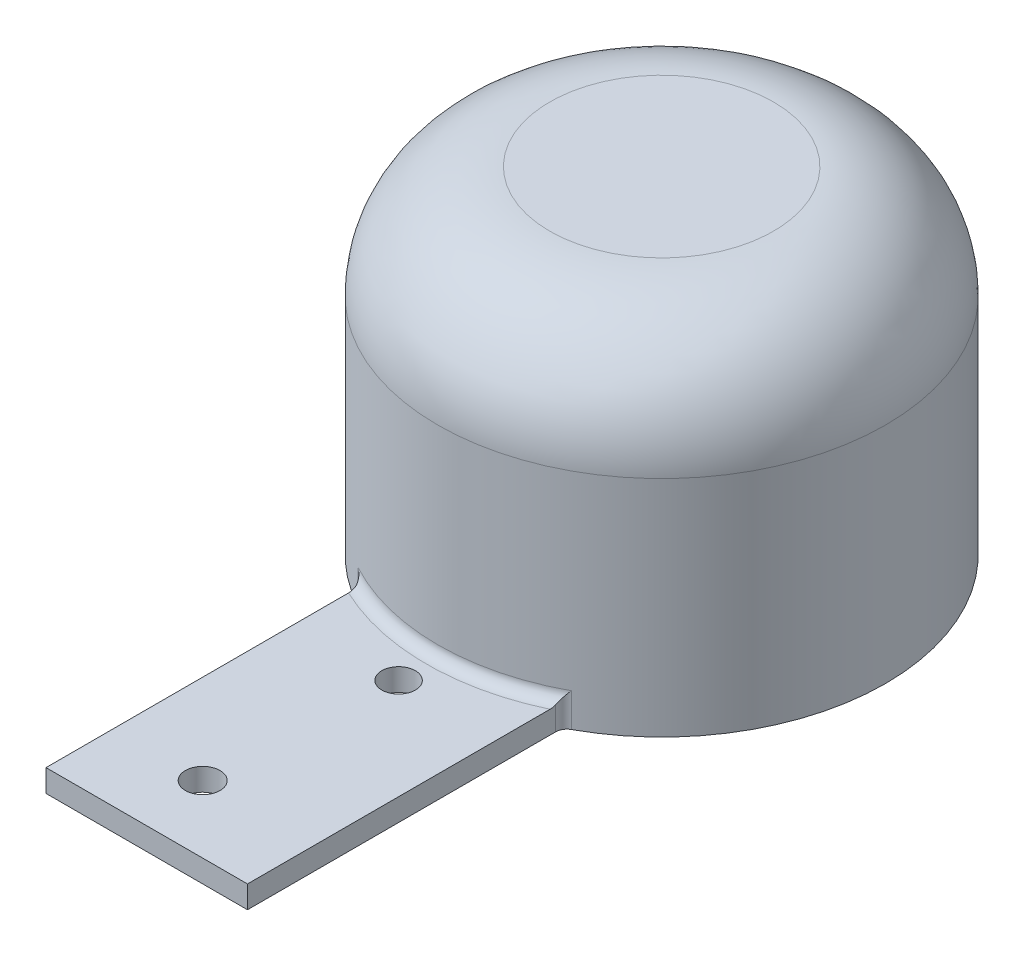
ISO-10303-21;
HEADER;
FILE_DESCRIPTION(('STEP AP214'),'2;1');
FILE_NAME('part.step','',(''),(''),'','','');
FILE_SCHEMA(('AUTOMOTIVE_DESIGN { 1 0 10303 214 1 1 1 1 }'));
ENDSEC;
DATA;
#1=APPLICATION_CONTEXT('core data for automotive mechanical design processes');
#2=APPLICATION_PROTOCOL_DEFINITION('international standard','automotive_design',2000,#1);
#3=PRODUCT_CONTEXT('',#1,'mechanical');
#4=PRODUCT('Part','Part','',(#3));
#5=PRODUCT_RELATED_PRODUCT_CATEGORY('part','',(#4));
#6=PRODUCT_DEFINITION_FORMATION('','',#4);
#7=PRODUCT_DEFINITION_CONTEXT('part definition',#1,'design');
#8=PRODUCT_DEFINITION('design','',#6,#7);
#9=PRODUCT_DEFINITION_SHAPE('','',#8);
#10=(LENGTH_UNIT() NAMED_UNIT(*) SI_UNIT(.MILLI.,.METRE.));
#11=(NAMED_UNIT(*) PLANE_ANGLE_UNIT() SI_UNIT($,.RADIAN.));
#12=(NAMED_UNIT(*) SI_UNIT($,.STERADIAN.) SOLID_ANGLE_UNIT());
#13=UNCERTAINTY_MEASURE_WITH_UNIT(LENGTH_MEASURE(1.E-05),#10,'distance_accuracy_value','');
#14=(GEOMETRIC_REPRESENTATION_CONTEXT(3) GLOBAL_UNCERTAINTY_ASSIGNED_CONTEXT((#13)) GLOBAL_UNIT_ASSIGNED_CONTEXT((#10,
#11,#12)) REPRESENTATION_CONTEXT('',''));
#15=CARTESIAN_POINT('',(0.,0.,0.));
#16=DIRECTION('',(0.,0.,1.));
#17=DIRECTION('',(1.,0.,0.));
#18=AXIS2_PLACEMENT_3D('',#15,#16,#17);
#19=CARTESIAN_POINT('',(0.,30.,0.));
#20=DIRECTION('',(0.,-1.,0.));
#21=DIRECTION('',(0.,0.,-1.));
#22=AXIS2_PLACEMENT_3D('',#19,#20,#21);
#23=CYLINDRICAL_SURFACE('',#22,20.);
#24=CARTESIAN_POINT('',(0.,20.,0.));
#25=DIRECTION('',(0.,1.,0.));
#26=DIRECTION('',(0.,0.,1.));
#27=AXIS2_PLACEMENT_3D('',#24,#25,#26);
#28=CIRCLE('',#27,20.);
#29=CARTESIAN_POINT('',(0.,20.,20.));
#30=VERTEX_POINT('',#29);
#31=EDGE_CURVE('E11',#30,#30,#28,.F.);
#32=ORIENTED_EDGE('',*,*,#31,.T.);
#33=EDGE_LOOP('',(#32));
#34=FACE_BOUND('',#33,.T.);
#35=CARTESIAN_POINT('',(0.,0.,0.));
#36=DIRECTION('',(0.,1.,0.));
#37=DIRECTION('',(0.,0.,1.));
#38=AXIS2_PLACEMENT_3D('',#35,#36,#37);
#39=CIRCLE('',#38,20.);
#40=CARTESIAN_POINT('',(9.52380952380952,0.,17.5868431548756));
#41=VERTEX_POINT('',#40);
#42=CARTESIAN_POINT('',(-9.52380952380952,0.,17.5868431548756));
#43=VERTEX_POINT('',#42);
#44=EDGE_CURVE('E138',#41,#43,#39,.T.);
#45=ORIENTED_EDGE('',*,*,#44,.T.);
#46=DIRECTION('',(0.,-1.,0.));
#47=VECTOR('',#46,1.);
#48=CARTESIAN_POINT('',(-9.52380952380952,30.,17.5868431548756));
#49=LINE('',#48,#47);
#50=CARTESIAN_POINT('',(-9.52380952380952,3.,17.5868431548756));
#51=VERTEX_POINT('',#50);
#52=EDGE_CURVE('E147',#43,#51,#49,.F.);
#53=ORIENTED_EDGE('',*,*,#52,.T.);
#54=CARTESIAN_POINT('',(0.,3.,0.));
#55=DIRECTION('',(0.,1.,0.));
#56=DIRECTION('',(0.,0.,1.));
#57=AXIS2_PLACEMENT_3D('',#54,#55,#56);
#58=CIRCLE('',#57,20.);
#59=CARTESIAN_POINT('',(9.52380952380952,3.,17.5868431548756));
#60=VERTEX_POINT('',#59);
#61=EDGE_CURVE('E143',#51,#60,#58,.T.);
#62=ORIENTED_EDGE('',*,*,#61,.T.);
#63=DIRECTION('',(0.,-1.,0.));
#64=VECTOR('',#63,1.);
#65=CARTESIAN_POINT('',(9.52380952380952,30.,17.5868431548756));
#66=LINE('',#65,#64);
#67=EDGE_CURVE('E145',#60,#41,#66,.T.);
#68=ORIENTED_EDGE('',*,*,#67,.T.);
#69=EDGE_LOOP('',(#45,#53,#62,#68));
#70=FACE_BOUND('',#69,.T.);
#71=ADVANCED_FACE('F40',(#34,#70),#23,.T.);
#72=CARTESIAN_POINT('',(0.,30.,0.));
#73=DIRECTION('',(0.,1.,0.));
#74=DIRECTION('',(0.,0.,1.));
#75=AXIS2_PLACEMENT_3D('',#72,#73,#74);
#76=PLANE('',#75);
#77=CARTESIAN_POINT('',(0.,30.,0.));
#78=DIRECTION('',(0.,1.,0.));
#79=DIRECTION('',(0.,0.,1.));
#80=AXIS2_PLACEMENT_3D('',#77,#78,#79);
#81=CIRCLE('',#80,10.);
#82=CARTESIAN_POINT('',(0.,30.,10.));
#83=VERTEX_POINT('',#82);
#84=EDGE_CURVE('E48',#83,#83,#81,.T.);
#85=ORIENTED_EDGE('',*,*,#84,.T.);
#86=EDGE_LOOP('',(#85));
#87=FACE_BOUND('',#86,.T.);
#88=ADVANCED_FACE('F184',(#87),#76,.T.);
#89=CARTESIAN_POINT('',(0.,0.,0.));
#90=DIRECTION('',(0.,1.,0.));
#91=DIRECTION('',(0.,0.,1.));
#92=AXIS2_PLACEMENT_3D('',#89,#90,#91);
#93=PLANE('',#92);
#94=CARTESIAN_POINT('',(-1.00000000000015,0.,39.9999999999996));
#95=DIRECTION('',(0.,1.,0.));
#96=DIRECTION('',(0.,0.,1.));
#97=AXIS2_PLACEMENT_3D('',#94,#95,#96);
#98=CIRCLE('',#97,1.54999999999999);
#99=CARTESIAN_POINT('',(-1.00000000000015,0.,41.5499999999996));
#100=VERTEX_POINT('',#99);
#101=EDGE_CURVE('E136',#100,#100,#98,.F.);
#102=ORIENTED_EDGE('',*,*,#101,.F.);
#103=EDGE_LOOP('',(#102));
#104=FACE_BOUND('',#103,.T.);
#105=CARTESIAN_POINT('',(0.,0.,23.4999999999999));
#106=DIRECTION('',(0.,1.,0.));
#107=DIRECTION('',(0.,0.,1.));
#108=AXIS2_PLACEMENT_3D('',#105,#106,#107);
#109=CIRCLE('',#108,1.5);
#110=CARTESIAN_POINT('',(0.,0.,24.9999999999999));
#111=VERTEX_POINT('',#110);
#112=EDGE_CURVE('E208',#111,#111,#109,.F.);
#113=ORIENTED_EDGE('',*,*,#112,.F.);
#114=EDGE_LOOP('',(#113));
#115=FACE_BOUND('',#114,.T.);
#116=ORIENTED_EDGE('',*,*,#44,.F.);
#117=CARTESIAN_POINT('',(9.99999999999999,0.,18.4661853126194));
#118=DIRECTION('',(0.,1.,0.));
#119=DIRECTION('',(0.,0.,1.));
#120=AXIS2_PLACEMENT_3D('',#117,#118,#119);
#121=CIRCLE('',#120,1.);
#122=CARTESIAN_POINT('',(8.99999999999999,0.,18.4661853126194));
#123=VERTEX_POINT('',#122);
#124=EDGE_CURVE('E153',#41,#123,#121,.T.);
#125=ORIENTED_EDGE('',*,*,#124,.T.);
#126=DIRECTION('',(0.,0.,1.));
#127=VECTOR('',#126,1.);
#128=CARTESIAN_POINT('',(9.,0.,46.));
#129=LINE('',#128,#127);
#130=CARTESIAN_POINT('',(9.,0.,46.));
#131=VERTEX_POINT('',#130);
#132=EDGE_CURVE('E126',#123,#131,#129,.T.);
#133=ORIENTED_EDGE('',*,*,#132,.T.);
#134=DIRECTION('',(-1.,0.,0.));
#135=VECTOR('',#134,1.);
#136=CARTESIAN_POINT('',(-9.,0.,46.));
#137=LINE('',#136,#135);
#138=CARTESIAN_POINT('',(-9.,0.,46.));
#139=VERTEX_POINT('',#138);
#140=EDGE_CURVE('E134',#131,#139,#137,.T.);
#141=ORIENTED_EDGE('',*,*,#140,.T.);
#142=DIRECTION('',(0.,0.,-1.));
#143=VECTOR('',#142,1.);
#144=CARTESIAN_POINT('',(-9.,0.,46.));
#145=LINE('',#144,#143);
#146=CARTESIAN_POINT('',(-8.99999999999999,0.,18.4661853126194));
#147=VERTEX_POINT('',#146);
#148=EDGE_CURVE('E107',#139,#147,#145,.T.);
#149=ORIENTED_EDGE('',*,*,#148,.T.);
#150=CARTESIAN_POINT('',(-9.99999999999999,0.,18.4661853126194));
#151=DIRECTION('',(0.,1.,0.));
#152=DIRECTION('',(0.,0.,1.));
#153=AXIS2_PLACEMENT_3D('',#150,#151,#152);
#154=CIRCLE('',#153,1.);
#155=EDGE_CURVE('E151',#147,#43,#154,.T.);
#156=ORIENTED_EDGE('',*,*,#155,.T.);
#157=EDGE_LOOP('',(#116,#125,#133,#141,#149,#156));
#158=FACE_BOUND('',#157,.T.);
#159=ADVANCED_FACE('F183',(#104,#115,#158),#93,.F.);
#160=CARTESIAN_POINT('',(-9.,2.,46.));
#161=DIRECTION('',(0.,0.,1.));
#162=DIRECTION('',(1.,0.,0.));
#163=AXIS2_PLACEMENT_3D('',#160,#161,#162);
#164=PLANE('',#163);
#165=ORIENTED_EDGE('',*,*,#140,.F.);
#166=DIRECTION('',(0.,-1.,0.));
#167=VECTOR('',#166,1.);
#168=CARTESIAN_POINT('',(9.,2.,46.));
#169=LINE('',#168,#167);
#170=CARTESIAN_POINT('',(9.,2.,46.));
#171=VERTEX_POINT('',#170);
#172=EDGE_CURVE('E112',#171,#131,#169,.T.);
#173=ORIENTED_EDGE('',*,*,#172,.F.);
#174=DIRECTION('',(-1.,0.,0.));
#175=VECTOR('',#174,1.);
#176=CARTESIAN_POINT('',(-9.,2.,46.));
#177=LINE('',#176,#175);
#178=CARTESIAN_POINT('',(-9.,2.,46.));
#179=VERTEX_POINT('',#178);
#180=EDGE_CURVE('E119',#171,#179,#177,.T.);
#181=ORIENTED_EDGE('',*,*,#180,.T.);
#182=DIRECTION('',(0.,-1.,0.));
#183=VECTOR('',#182,1.);
#184=CARTESIAN_POINT('',(-9.,2.,46.));
#185=LINE('',#184,#183);
#186=EDGE_CURVE('E101',#179,#139,#185,.T.);
#187=ORIENTED_EDGE('',*,*,#186,.T.);
#188=EDGE_LOOP('',(#165,#173,#181,#187));
#189=FACE_BOUND('',#188,.T.);
#190=ADVANCED_FACE('F124',(#189),#164,.T.);
#191=CARTESIAN_POINT('',(9.,2.,46.));
#192=DIRECTION('',(1.,0.,0.));
#193=DIRECTION('',(0.,0.,-1.));
#194=AXIS2_PLACEMENT_3D('',#191,#192,#193);
#195=PLANE('',#194);
#196=ORIENTED_EDGE('',*,*,#132,.F.);
#197=DIRECTION('',(0.,-1.,0.));
#198=VECTOR('',#197,1.);
#199=CARTESIAN_POINT('',(8.99999999999999,2.,18.4661853126194));
#200=LINE('',#199,#198);
#201=CARTESIAN_POINT('',(8.99999999999999,2.11071909088648,18.4661853126194));
#202=VERTEX_POINT('',#201);
#203=EDGE_CURVE('E55',#123,#202,#200,.F.);
#204=ORIENTED_EDGE('',*,*,#203,.T.);
#205=CARTESIAN_POINT('',(8.99999999999999,2.11071909088648,18.4661853126194));
#206=CARTESIAN_POINT('',(8.99999999999999,2.08190904971703,18.5284357282284));
#207=CARTESIAN_POINT('',(8.99999999999999,2.05863920023435,18.5932090145921));
#208=CARTESIAN_POINT('',(8.99999999999999,2.02368482177248,18.7245904768813));
#209=CARTESIAN_POINT('',(8.99999999999999,2.01180284569598,18.791146006215));
#210=CARTESIAN_POINT('',(8.99999999999999,2.00181456816458,18.8965806496699));
#211=CARTESIAN_POINT('',(8.99999999999999,1.99999151511758,18.9351348038869));
#212=CARTESIAN_POINT('',(8.99999999999999,2.,18.9736659610103));
#213=B_SPLINE_CURVE_WITH_KNOTS('',3,(#205,#206,#207,#208,#209,#210,#211,#212),.UNSPECIFIED.,.F.,
.F.,(4,2,2,4),(0.,0.205486660646248,0.407342371931672,0.522951832957336),.UNSPECIFIED.);
#214=CARTESIAN_POINT('',(8.99999999999999,2.,18.9736659610103));
#215=VERTEX_POINT('',#214);
#216=EDGE_CURVE('E155',#202,#215,#213,.T.);
#217=ORIENTED_EDGE('',*,*,#216,.T.);
#218=DIRECTION('',(0.,0.,1.));
#219=VECTOR('',#218,1.);
#220=CARTESIAN_POINT('',(9.,2.,46.));
#221=LINE('',#220,#219);
#222=EDGE_CURVE('E113',#215,#171,#221,.T.);
#223=ORIENTED_EDGE('',*,*,#222,.T.);
#224=ORIENTED_EDGE('',*,*,#172,.T.);
#225=EDGE_LOOP('',(#196,#204,#217,#223,#224));
#226=FACE_BOUND('',#225,.T.);
#227=ADVANCED_FACE('F173',(#226),#195,.T.);
#228=CARTESIAN_POINT('',(-9.,2.,46.));
#229=DIRECTION('',(-1.,0.,0.));
#230=DIRECTION('',(0.,0.,1.));
#231=AXIS2_PLACEMENT_3D('',#228,#229,#230);
#232=PLANE('',#231);
#233=DIRECTION('',(0.,0.,-1.));
#234=VECTOR('',#233,1.);
#235=CARTESIAN_POINT('',(-9.,2.,46.));
#236=LINE('',#235,#234);
#237=CARTESIAN_POINT('',(-8.99999999999999,2.,18.9736659610103));
#238=VERTEX_POINT('',#237);
#239=EDGE_CURVE('E104',#179,#238,#236,.T.);
#240=ORIENTED_EDGE('',*,*,#239,.T.);
#241=CARTESIAN_POINT('',(-9.,2.,18.9736659610103));
#242=CARTESIAN_POINT('',(-8.99999999999999,1.99995897591919,18.9055650918138));
#243=CARTESIAN_POINT('',(-8.99999999999999,2.0056778531025,18.8373644119303));
#244=CARTESIAN_POINT('',(-8.99999999999999,2.02830265297187,18.7032503979594));
#245=CARTESIAN_POINT('',(-8.99999999999999,2.04514427435758,18.6373261950326));
#246=CARTESIAN_POINT('',(-8.99999999999999,2.07374036379076,18.5552152219705));
#247=CARTESIAN_POINT('',(-8.99999999999999,2.08050253667488,18.5372146219989));
#248=CARTESIAN_POINT('',(-8.99999999999999,2.09493429326351,18.5014717915302));
#249=CARTESIAN_POINT('',(-8.99999999999999,2.10260842381487,18.4837313972347));
#250=CARTESIAN_POINT('',(-8.99999999999999,2.11071909088648,18.4661853126194));
#251=B_SPLINE_CURVE_WITH_KNOTS('',3,(#241,#242,#243,#244,#245,#246,#247,#248,#249,#250),
.UNSPECIFIED.,.F.,.F.,(4,2,2,2,4),(0.,0.204261818619548,0.407353003503905,0.465023016773679,
0.522993683033314),.UNSPECIFIED.);
#252=CARTESIAN_POINT('',(-8.99999999999999,2.11071909088648,18.4661853126194));
#253=VERTEX_POINT('',#252);
#254=EDGE_CURVE('E163',#238,#253,#251,.T.);
#255=ORIENTED_EDGE('',*,*,#254,.T.);
#256=DIRECTION('',(0.,-1.,0.));
#257=VECTOR('',#256,1.);
#258=CARTESIAN_POINT('',(-8.99999999999999,2.,18.4661853126194));
#259=LINE('',#258,#257);
#260=EDGE_CURVE('E63',#253,#147,#259,.T.);
#261=ORIENTED_EDGE('',*,*,#260,.T.);
#262=ORIENTED_EDGE('',*,*,#148,.F.);
#263=ORIENTED_EDGE('',*,*,#186,.F.);
#264=EDGE_LOOP('',(#240,#255,#261,#262,#263));
#265=FACE_BOUND('',#264,.T.);
#266=ADVANCED_FACE('F103',(#265),#232,.T.);
#267=CARTESIAN_POINT('',(0.,2.,0.));
#268=DIRECTION('',(0.,1.,0.));
#269=DIRECTION('',(0.,0.,1.));
#270=AXIS2_PLACEMENT_3D('',#267,#268,#269);
#271=PLANE('',#270);
#272=CARTESIAN_POINT('',(-1.00000000000015,2.,39.9999999999996));
#273=DIRECTION('',(0.,1.,0.));
#274=DIRECTION('',(0.,0.,1.));
#275=AXIS2_PLACEMENT_3D('',#272,#273,#274);
#276=CIRCLE('',#275,1.54999999999999);
#277=CARTESIAN_POINT('',(-1.00000000000015,2.,41.5499999999996));
#278=VERTEX_POINT('',#277);
#279=EDGE_CURVE('E352',#278,#278,#276,.T.);
#280=ORIENTED_EDGE('',*,*,#279,.F.);
#281=EDGE_LOOP('',(#280));
#282=FACE_BOUND('',#281,.T.);
#283=CARTESIAN_POINT('',(0.,2.,23.4999999999999));
#284=DIRECTION('',(0.,1.,0.));
#285=DIRECTION('',(0.,0.,1.));
#286=AXIS2_PLACEMENT_3D('',#283,#284,#285);
#287=CIRCLE('',#286,1.5);
#288=CARTESIAN_POINT('',(0.,2.,24.9999999999999));
#289=VERTEX_POINT('',#288);
#290=EDGE_CURVE('E130',#289,#289,#287,.T.);
#291=ORIENTED_EDGE('',*,*,#290,.F.);
#292=EDGE_LOOP('',(#291));
#293=FACE_BOUND('',#292,.T.);
#294=ORIENTED_EDGE('',*,*,#222,.F.);
#295=CARTESIAN_POINT('',(0.,2.,0.));
#296=DIRECTION('',(0.,1.,0.));
#297=DIRECTION('',(0.,0.,1.));
#298=AXIS2_PLACEMENT_3D('',#295,#296,#297);
#299=CIRCLE('',#298,21.);
#300=EDGE_CURVE('E121',#215,#238,#299,.F.);
#301=ORIENTED_EDGE('',*,*,#300,.T.);
#302=ORIENTED_EDGE('',*,*,#239,.F.);
#303=ORIENTED_EDGE('',*,*,#180,.F.);
#304=EDGE_LOOP('',(#294,#301,#302,#303));
#305=FACE_BOUND('',#304,.T.);
#306=ADVANCED_FACE('F118',(#282,#293,#305),#271,.T.);
#307=CARTESIAN_POINT('',(0.,-4.38406204335656,23.4999999999999));
#308=DIRECTION('',(0.,1.,0.));
#309=DIRECTION('',(0.,0.,1.));
#310=AXIS2_PLACEMENT_3D('',#307,#308,#309);
#311=CYLINDRICAL_SURFACE('',#310,1.5);
#312=ORIENTED_EDGE('',*,*,#112,.T.);
#313=EDGE_LOOP('',(#312));
#314=FACE_BOUND('',#313,.T.);
#315=ORIENTED_EDGE('',*,*,#290,.T.);
#316=EDGE_LOOP('',(#315));
#317=FACE_BOUND('',#316,.T.);
#318=ADVANCED_FACE('F219',(#314,#317),#311,.F.);
#319=CARTESIAN_POINT('',(-1.00000000000015,-4.38406204335656,39.9999999999996));
#320=DIRECTION('',(0.,1.,0.));
#321=DIRECTION('',(0.,0.,1.));
#322=AXIS2_PLACEMENT_3D('',#319,#320,#321);
#323=CYLINDRICAL_SURFACE('',#322,1.54999999999999);
#324=ORIENTED_EDGE('',*,*,#101,.T.);
#325=EDGE_LOOP('',(#324));
#326=FACE_BOUND('',#325,.T.);
#327=ORIENTED_EDGE('',*,*,#279,.T.);
#328=EDGE_LOOP('',(#327));
#329=FACE_BOUND('',#328,.T.);
#330=ADVANCED_FACE('F212',(#326,#329),#323,.F.);
#331=CARTESIAN_POINT('',(9.99999999999999,30.,18.4661853126194));
#332=DIRECTION('',(0.,-1.,0.));
#333=DIRECTION('',(0.,0.,-1.));
#334=AXIS2_PLACEMENT_3D('',#331,#332,#333);
#335=CYLINDRICAL_SURFACE('',#334,1.);
#336=ORIENTED_EDGE('',*,*,#124,.F.);
#337=ORIENTED_EDGE('',*,*,#67,.F.);
#338=CARTESIAN_POINT('',(8.99999999999999,2.11071909088648,18.4661853126194));
#339=CARTESIAN_POINT('',(9.00000214151194,2.12467073482759,18.4360106667873));
#340=CARTESIAN_POINT('',(9.00136515340101,2.1396356229801,18.4063520016772));
#341=CARTESIAN_POINT('',(9.00655038284719,2.17126911399362,18.3482561690932));
#342=CARTESIAN_POINT('',(9.01036741128643,2.18793405960205,18.3198165589155));
#343=CARTESIAN_POINT('',(9.02502011234726,2.23975034894762,18.2369684373898));
#344=CARTESIAN_POINT('',(9.03906802516147,2.27700855070658,18.1844338807856));
#345=CARTESIAN_POINT('',(9.07960028113371,2.36780920412367,18.0690565484306));
#346=CARTESIAN_POINT('',(9.10861924544886,2.42276146437505,18.0082510195917));
#347=CARTESIAN_POINT('',(9.17588400407988,2.53686355419511,17.8959800328573));
#348=CARTESIAN_POINT('',(9.21417490353888,2.59603287384832,17.8445624576742));
#349=CARTESIAN_POINT('',(9.29462449582305,2.71169187193162,17.7550115848264));
#350=CARTESIAN_POINT('',(9.33621966185733,2.76801107066323,17.7161400996517));
#351=CARTESIAN_POINT('',(9.42447338088158,2.88139456347549,17.6464794920594));
#352=CARTESIAN_POINT('',(9.47111735565786,2.93845631479513,17.6156679329866));
#353=CARTESIAN_POINT('',(9.52122158208384,2.99698247075875,17.5882483084452));
#354=CARTESIAN_POINT('',(9.52251479747748,2.99849125550883,17.5875442953472));
#355=CARTESIAN_POINT('',(9.52380952380952,3.,17.5868431548756));
#356=B_SPLINE_CURVE_WITH_KNOTS('',3,(#338,#339,#340,#341,#342,#343,#344,#345,#346,#347,#348,
#349,#350,#351,#352,#353,#354,#355),.UNSPECIFIED.,.F.,.F.,(4,2,2,2,2,2,2,2,4),(0.,
0.0996170943333421,0.199024234000251,0.395884002996554,0.655368656002772,0.916141919855677,
1.15581822122725,1.39482005233558,1.40114461518074),.UNSPECIFIED.);
#357=EDGE_CURVE('E202',#202,#60,#356,.T.);
#358=ORIENTED_EDGE('',*,*,#357,.F.);
#359=ORIENTED_EDGE('',*,*,#203,.F.);
#360=EDGE_LOOP('',(#336,#337,#358,#359));
#361=FACE_BOUND('',#360,.T.);
#362=ADVANCED_FACE('F209',(#361),#335,.F.);
#363=CARTESIAN_POINT('',(0.,3.,0.));
#364=DIRECTION('',(0.,1.,0.));
#365=DIRECTION('',(0.,0.,1.));
#366=AXIS2_PLACEMENT_3D('',#363,#364,#365);
#367=TOROIDAL_SURFACE('',#366,21.,1.);
#368=ORIENTED_EDGE('',*,*,#357,.T.);
#369=ORIENTED_EDGE('',*,*,#61,.F.);
#370=CARTESIAN_POINT('',(-8.99999999999999,2.11071909088648,18.4661853126194));
#371=CARTESIAN_POINT('',(-9.00000214151194,2.12467073482759,18.4360106667873));
#372=CARTESIAN_POINT('',(-9.00136515340101,2.1396356229801,18.4063520016772));
#373=CARTESIAN_POINT('',(-9.00655038284719,2.17126911399362,18.3482561690932));
#374=CARTESIAN_POINT('',(-9.01036741128643,2.18793405960205,18.3198165589155));
#375=CARTESIAN_POINT('',(-9.02502011234726,2.23975034894762,18.2369684373898));
#376=CARTESIAN_POINT('',(-9.03906802516147,2.27700855070658,18.1844338807856));
#377=CARTESIAN_POINT('',(-9.07960028113371,2.36780920412367,18.0690565484306));
#378=CARTESIAN_POINT('',(-9.10861924544886,2.42276146437505,18.0082510195917));
#379=CARTESIAN_POINT('',(-9.17588400407988,2.53686355419511,17.8959800328573));
#380=CARTESIAN_POINT('',(-9.21417490353888,2.59603287384832,17.8445624576742));
#381=CARTESIAN_POINT('',(-9.29462449582305,2.71169187193162,17.7550115848264));
#382=CARTESIAN_POINT('',(-9.33621966185733,2.76801107066323,17.7161400996517));
#383=CARTESIAN_POINT('',(-9.42447338088158,2.88139456347549,17.6464794920594));
#384=CARTESIAN_POINT('',(-9.47111735565786,2.93845631479513,17.6156679329866));
#385=CARTESIAN_POINT('',(-9.52122158208384,2.99698247075875,17.5882483084452));
#386=CARTESIAN_POINT('',(-9.52251479747748,2.99849125550883,17.5875442953472));
#387=CARTESIAN_POINT('',(-9.52380952380952,3.,17.5868431548756));
#388=B_SPLINE_CURVE_WITH_KNOTS('',3,(#370,#371,#372,#373,#374,#375,#376,#377,#378,#379,#380,
#381,#382,#383,#384,#385,#386,#387),.UNSPECIFIED.,.F.,.F.,(4,2,2,2,2,2,2,2,4),(0.,
0.0996170943333421,0.199024234000251,0.395884002996554,0.655368656002772,0.916141919855677,
1.15581822122725,1.39482005233558,1.40114461518074),.UNSPECIFIED.);
#389=EDGE_CURVE('E196',#253,#51,#388,.T.);
#390=ORIENTED_EDGE('',*,*,#389,.F.);
#391=ORIENTED_EDGE('',*,*,#254,.F.);
#392=ORIENTED_EDGE('',*,*,#300,.F.);
#393=ORIENTED_EDGE('',*,*,#216,.F.);
#394=EDGE_LOOP('',(#368,#369,#390,#391,#392,#393));
#395=FACE_BOUND('',#394,.T.);
#396=ADVANCED_FACE('F170',(#395),#367,.F.);
#397=CARTESIAN_POINT('',(-9.99999999999999,30.,18.4661853126194));
#398=DIRECTION('',(0.,-1.,0.));
#399=DIRECTION('',(0.,0.,-1.));
#400=AXIS2_PLACEMENT_3D('',#397,#398,#399);
#401=CYLINDRICAL_SURFACE('',#400,1.);
#402=ORIENTED_EDGE('',*,*,#389,.T.);
#403=ORIENTED_EDGE('',*,*,#52,.F.);
#404=ORIENTED_EDGE('',*,*,#155,.F.);
#405=ORIENTED_EDGE('',*,*,#260,.F.);
#406=EDGE_LOOP('',(#402,#403,#404,#405));
#407=FACE_BOUND('',#406,.T.);
#408=ADVANCED_FACE('F193',(#407),#401,.F.);
#409=CARTESIAN_POINT('',(0.,20.,0.));
#410=DIRECTION('',(0.,1.,0.));
#411=DIRECTION('',(0.,0.,1.));
#412=AXIS2_PLACEMENT_3D('',#409,#410,#411);
#413=DEGENERATE_TOROIDAL_SURFACE('',#412,10.,10.,.T.);
#414=ORIENTED_EDGE('',*,*,#31,.F.);
#415=EDGE_LOOP('',(#414));
#416=FACE_BOUND('',#415,.T.);
#417=ORIENTED_EDGE('',*,*,#84,.F.);
#418=EDGE_LOOP('',(#417));
#419=FACE_BOUND('',#418,.T.);
#420=ADVANCED_FACE('F42',(#416,#419),#413,.T.);
#421=CLOSED_SHELL('',(#71,#88,#159,#190,#227,#266,#306,#318,#330,#362,#396,#408,#420));
#422=MANIFOLD_SOLID_BREP('B2',#421);
#423=ADVANCED_BREP_SHAPE_REPRESENTATION('',(#18,#422),#14);
#424=SHAPE_DEFINITION_REPRESENTATION(#9,#423);
ENDSEC;
END-ISO-10303-21;
